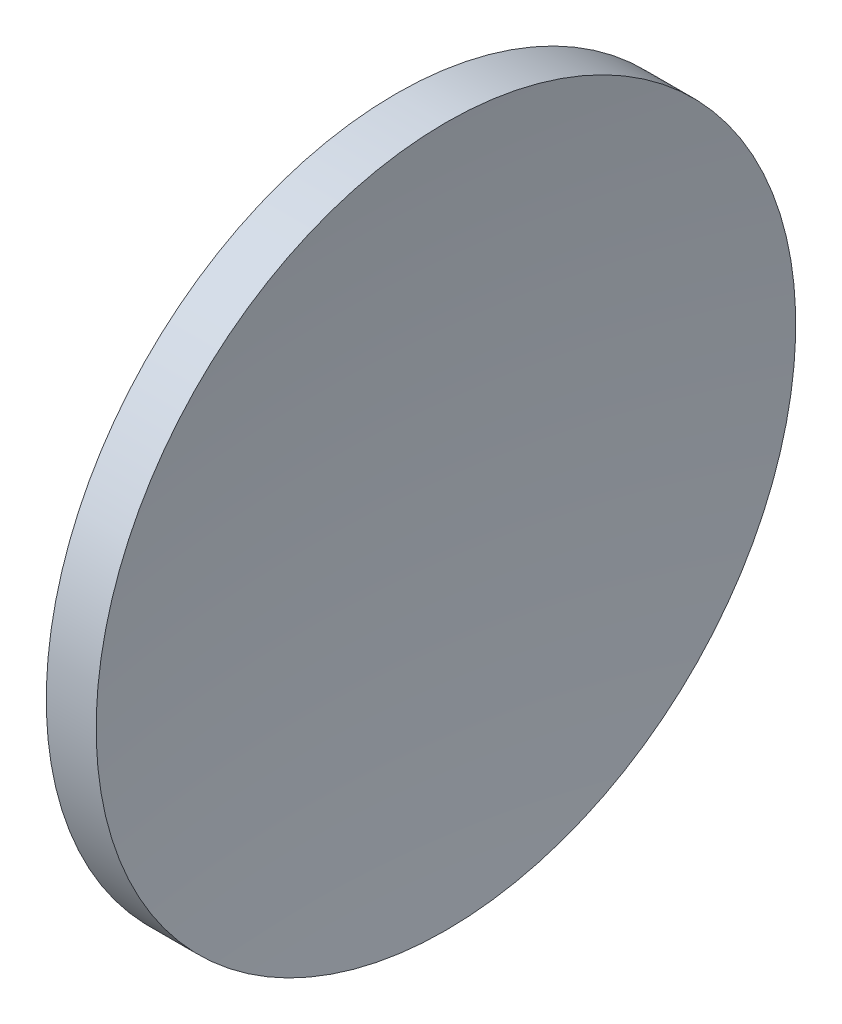
ISO-10303-21;
HEADER;
FILE_DESCRIPTION(('STEP AP214'),'2;1');
FILE_NAME('part.step','',(''),(''),'','','');
FILE_SCHEMA(('AUTOMOTIVE_DESIGN { 1 0 10303 214 1 1 1 1 }'));
ENDSEC;
DATA;
#1=APPLICATION_CONTEXT('core data for automotive mechanical design processes');
#2=APPLICATION_PROTOCOL_DEFINITION('international standard','automotive_design',2000,#1);
#3=PRODUCT_CONTEXT('',#1,'mechanical');
#4=PRODUCT('Part','Part','',(#3));
#5=PRODUCT_RELATED_PRODUCT_CATEGORY('part','',(#4));
#6=PRODUCT_DEFINITION_FORMATION('','',#4);
#7=PRODUCT_DEFINITION_CONTEXT('part definition',#1,'design');
#8=PRODUCT_DEFINITION('design','',#6,#7);
#9=PRODUCT_DEFINITION_SHAPE('','',#8);
#10=(LENGTH_UNIT() NAMED_UNIT(*) SI_UNIT(.MILLI.,.METRE.));
#11=(NAMED_UNIT(*) PLANE_ANGLE_UNIT() SI_UNIT($,.RADIAN.));
#12=(NAMED_UNIT(*) SI_UNIT($,.STERADIAN.) SOLID_ANGLE_UNIT());
#13=UNCERTAINTY_MEASURE_WITH_UNIT(LENGTH_MEASURE(1.E-05),#10,'distance_accuracy_value','');
#14=(GEOMETRIC_REPRESENTATION_CONTEXT(3) GLOBAL_UNCERTAINTY_ASSIGNED_CONTEXT((#13)) GLOBAL_UNIT_ASSIGNED_CONTEXT((#10,
#11,#12)) REPRESENTATION_CONTEXT('',''));
#15=CARTESIAN_POINT('',(0.,0.,0.));
#16=DIRECTION('',(0.,0.,1.));
#17=DIRECTION('',(1.,0.,0.));
#18=AXIS2_PLACEMENT_3D('',#15,#16,#17);
#19=CARTESIAN_POINT('',(314.68213112149,130.433680941881,0.));
#20=DIRECTION('',(-1.,0.,0.));
#21=DIRECTION('',(0.,1.,0.));
#22=AXIS2_PLACEMENT_3D('',#19,#20,#21);
#23=SPHERICAL_SURFACE('',#22,69.4);
#24=CARTESIAN_POINT('',(249.941417501698,130.433680941881,0.));
#25=DIRECTION('',(-1.,0.,0.));
#26=DIRECTION('',(0.,-1.,0.));
#27=AXIS2_PLACEMENT_3D('',#24,#25,#26);
#28=CIRCLE('',#27,24.9999999999999);
#29=CARTESIAN_POINT('',(249.941417501698,105.433680941881,0.));
#30=VERTEX_POINT('',#29);
#31=EDGE_CURVE('E41',#30,#30,#28,.T.);
#32=ORIENTED_EDGE('',*,*,#31,.T.);
#33=EDGE_LOOP('',(#32));
#34=FACE_BOUND('',#33,.T.);
#35=ADVANCED_FACE('F35',(#34),#23,.T.);
#36=CARTESIAN_POINT('',(445.08213112149,130.433680941881,0.));
#37=DIRECTION('',(-1.,0.,0.));
#38=DIRECTION('',(0.,1.,0.));
#39=AXIS2_PLACEMENT_3D('',#36,#37,#38);
#40=SPHERICAL_SURFACE('',#39,193.2);
#41=CARTESIAN_POINT('',(253.506454168491,130.433680941881,0.));
#42=DIRECTION('',(-1.,0.,0.));
#43=DIRECTION('',(0.,-1.,0.));
#44=AXIS2_PLACEMENT_3D('',#41,#42,#43);
#45=CIRCLE('',#44,25.);
#46=CARTESIAN_POINT('',(253.506454168491,105.433680941881,0.));
#47=VERTEX_POINT('',#46);
#48=EDGE_CURVE('E10',#47,#47,#45,.T.);
#49=ORIENTED_EDGE('',*,*,#48,.F.);
#50=EDGE_LOOP('',(#49));
#51=FACE_BOUND('',#50,.T.);
#52=ADVANCED_FACE('F50',(#51),#40,.F.);
#53=CARTESIAN_POINT('',(231.888982595926,130.433680941881,0.));
#54=DIRECTION('',(-1.,0.,0.));
#55=DIRECTION('',(0.,-1.,0.));
#56=AXIS2_PLACEMENT_3D('',#53,#54,#55);
#57=CYLINDRICAL_SURFACE('',#56,24.9999999999999);
#58=ORIENTED_EDGE('',*,*,#31,.F.);
#59=EDGE_LOOP('',(#58));
#60=FACE_BOUND('',#59,.T.);
#61=ORIENTED_EDGE('',*,*,#48,.T.);
#62=EDGE_LOOP('',(#61));
#63=FACE_BOUND('',#62,.T.);
#64=ADVANCED_FACE('F48',(#60,#63),#57,.T.);
#65=CLOSED_SHELL('',(#35,#52,#64));
#66=MANIFOLD_SOLID_BREP('B2',#65);
#67=ADVANCED_BREP_SHAPE_REPRESENTATION('',(#18,#66),#14);
#68=SHAPE_DEFINITION_REPRESENTATION(#9,#67);
ENDSEC;
END-ISO-10303-21;
